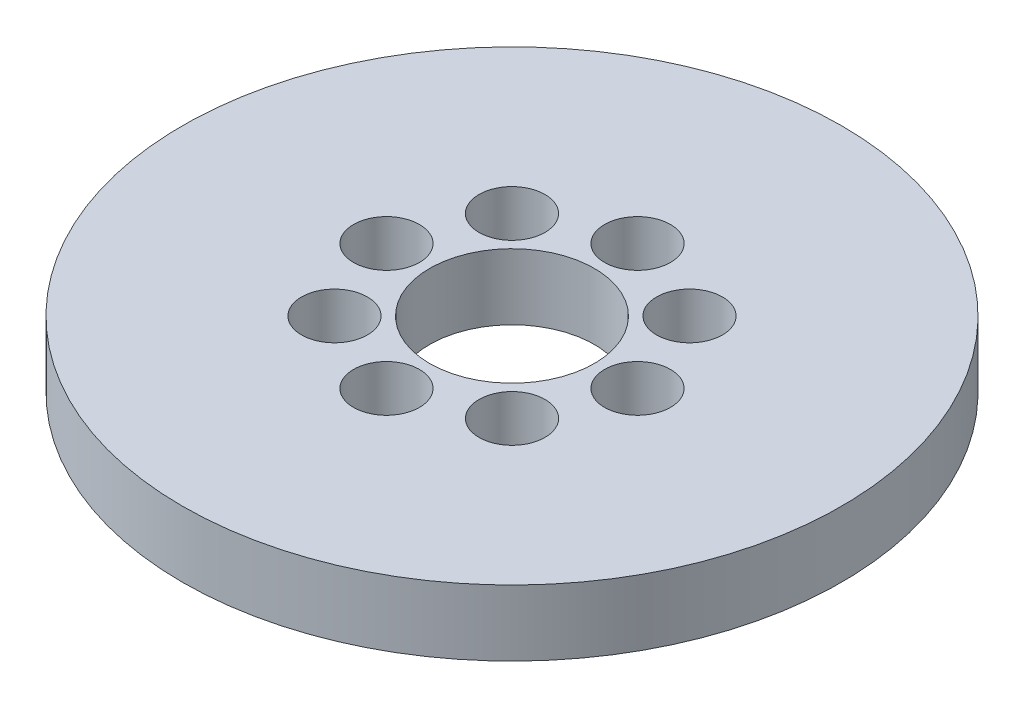
ISO-10303-21;
HEADER;
FILE_DESCRIPTION(('STEP AP214'),'2;1');
FILE_NAME('part.step','',(''),(''),'','','');
FILE_SCHEMA(('AUTOMOTIVE_DESIGN { 1 0 10303 214 1 1 1 1 }'));
ENDSEC;
DATA;
#1=APPLICATION_CONTEXT('core data for automotive mechanical design processes');
#2=APPLICATION_PROTOCOL_DEFINITION('international standard','automotive_design',2000,#1);
#3=PRODUCT_CONTEXT('',#1,'mechanical');
#4=PRODUCT('Part','Part','',(#3));
#5=PRODUCT_RELATED_PRODUCT_CATEGORY('part','',(#4));
#6=PRODUCT_DEFINITION_FORMATION('','',#4);
#7=PRODUCT_DEFINITION_CONTEXT('part definition',#1,'design');
#8=PRODUCT_DEFINITION('design','',#6,#7);
#9=PRODUCT_DEFINITION_SHAPE('','',#8);
#10=(LENGTH_UNIT() NAMED_UNIT(*) SI_UNIT(.MILLI.,.METRE.));
#11=(NAMED_UNIT(*) PLANE_ANGLE_UNIT() SI_UNIT($,.RADIAN.));
#12=(NAMED_UNIT(*) SI_UNIT($,.STERADIAN.) SOLID_ANGLE_UNIT());
#13=UNCERTAINTY_MEASURE_WITH_UNIT(LENGTH_MEASURE(1.E-05),#10,'distance_accuracy_value','');
#14=(GEOMETRIC_REPRESENTATION_CONTEXT(3) GLOBAL_UNCERTAINTY_ASSIGNED_CONTEXT((#13)) GLOBAL_UNIT_ASSIGNED_CONTEXT((#10,
#11,#12)) REPRESENTATION_CONTEXT('',''));
#15=CARTESIAN_POINT('',(0.,0.,0.));
#16=DIRECTION('',(0.,0.,1.));
#17=DIRECTION('',(1.,0.,0.));
#18=AXIS2_PLACEMENT_3D('',#15,#16,#17);
#19=CARTESIAN_POINT('',(0.,20.,0.));
#20=DIRECTION('',(0.,-1.,0.));
#21=DIRECTION('',(0.,0.,-1.));
#22=AXIS2_PLACEMENT_3D('',#19,#20,#21);
#23=CYLINDRICAL_SURFACE('',#22,100.);
#24=CARTESIAN_POINT('',(0.,20.,0.));
#25=DIRECTION('',(0.,1.,0.));
#26=DIRECTION('',(0.,0.,1.));
#27=AXIS2_PLACEMENT_3D('',#24,#25,#26);
#28=CIRCLE('',#27,100.);
#29=CARTESIAN_POINT('',(0.,20.,100.));
#30=VERTEX_POINT('',#29);
#31=EDGE_CURVE('E10',#30,#30,#28,.T.);
#32=ORIENTED_EDGE('',*,*,#31,.F.);
#33=EDGE_LOOP('',(#32));
#34=FACE_BOUND('',#33,.T.);
#35=CARTESIAN_POINT('',(0.,0.,0.));
#36=DIRECTION('',(0.,1.,0.));
#37=DIRECTION('',(0.,0.,1.));
#38=AXIS2_PLACEMENT_3D('',#35,#36,#37);
#39=CIRCLE('',#38,100.);
#40=CARTESIAN_POINT('',(0.,0.,100.));
#41=VERTEX_POINT('',#40);
#42=EDGE_CURVE('E37',#41,#41,#39,.T.);
#43=ORIENTED_EDGE('',*,*,#42,.T.);
#44=EDGE_LOOP('',(#43));
#45=FACE_BOUND('',#44,.T.);
#46=ADVANCED_FACE('F40',(#34,#45),#23,.T.);
#47=CARTESIAN_POINT('',(0.,20.,0.));
#48=DIRECTION('',(0.,1.,0.));
#49=DIRECTION('',(0.,0.,1.));
#50=AXIS2_PLACEMENT_3D('',#47,#48,#49);
#51=PLANE('',#50);
#52=CARTESIAN_POINT('',(1.32987160556969E-13,20.,38.0890366153391));
#53=DIRECTION('',(0.,1.,0.));
#54=DIRECTION('',(1.,0.,0.));
#55=AXIS2_PLACEMENT_3D('',#52,#53,#54);
#56=CIRCLE('',#55,10.);
#57=CARTESIAN_POINT('',(10.0000000000001,20.,38.089036615339));
#58=VERTEX_POINT('',#57);
#59=EDGE_CURVE('E88',#58,#58,#56,.T.);
#60=ORIENTED_EDGE('',*,*,#59,.F.);
#61=EDGE_LOOP('',(#60));
#62=FACE_BOUND('',#61,.T.);
#63=CARTESIAN_POINT('',(26.9330160795691,20.,26.9330160795688));
#64=DIRECTION('',(0.,1.,0.));
#65=DIRECTION('',(0.707106781186544,0.,-0.707106781186551));
#66=AXIS2_PLACEMENT_3D('',#63,#64,#65);
#67=CIRCLE('',#66,10.);
#68=CARTESIAN_POINT('',(34.0040838914345,20.,19.8619482677033));
#69=VERTEX_POINT('',#68);
#70=EDGE_CURVE('E79',#69,#69,#67,.T.);
#71=ORIENTED_EDGE('',*,*,#70,.F.);
#72=EDGE_LOOP('',(#71));
#73=FACE_BOUND('',#72,.T.);
#74=CARTESIAN_POINT('',(38.0890366153391,20.,0.));
#75=DIRECTION('',(0.,1.,0.));
#76=DIRECTION('',(0.,0.,-1.));
#77=AXIS2_PLACEMENT_3D('',#74,#75,#76);
#78=CIRCLE('',#77,10.);
#79=CARTESIAN_POINT('',(38.0890366153391,20.,-10.));
#80=VERTEX_POINT('',#79);
#81=EDGE_CURVE('E74',#80,#80,#78,.T.);
#82=ORIENTED_EDGE('',*,*,#81,.F.);
#83=EDGE_LOOP('',(#82));
#84=FACE_BOUND('',#83,.T.);
#85=CARTESIAN_POINT('',(26.9330160795687,20.,-26.9330160795692));
#86=DIRECTION('',(0.,1.,0.));
#87=DIRECTION('',(-0.707106781186554,0.,-0.707106781186541));
#88=AXIS2_PLACEMENT_3D('',#85,#86,#87);
#89=CIRCLE('',#88,10.);
#90=CARTESIAN_POINT('',(19.8619482677032,20.,-34.0040838914346));
#91=VERTEX_POINT('',#90);
#92=EDGE_CURVE('E70',#91,#91,#89,.T.);
#93=ORIENTED_EDGE('',*,*,#92,.F.);
#94=EDGE_LOOP('',(#93));
#95=FACE_BOUND('',#94,.T.);
#96=CARTESIAN_POINT('',(-3.98961481670907E-13,20.,-38.0890366153391));
#97=DIRECTION('',(0.,1.,0.));
#98=DIRECTION('',(-1.,0.,0.));
#99=AXIS2_PLACEMENT_3D('',#96,#97,#98);
#100=CIRCLE('',#99,10.);
#101=CARTESIAN_POINT('',(-10.0000000000004,20.,-38.089036615339));
#102=VERTEX_POINT('',#101);
#103=EDGE_CURVE('E100',#102,#102,#100,.T.);
#104=ORIENTED_EDGE('',*,*,#103,.F.);
#105=EDGE_LOOP('',(#104));
#106=FACE_BOUND('',#105,.T.);
#107=CARTESIAN_POINT('',(-26.9330160795693,20.,-26.9330160795686));
#108=DIRECTION('',(0.,1.,0.));
#109=DIRECTION('',(-0.707106781186539,0.,0.707106781186556));
#110=AXIS2_PLACEMENT_3D('',#107,#108,#109);
#111=CIRCLE('',#110,10.);
#112=CARTESIAN_POINT('',(-34.0040838914347,20.,-19.8619482677031));
#113=VERTEX_POINT('',#112);
#114=EDGE_CURVE('E93',#113,#113,#111,.T.);
#115=ORIENTED_EDGE('',*,*,#114,.F.);
#116=EDGE_LOOP('',(#115));
#117=FACE_BOUND('',#116,.T.);
#118=CARTESIAN_POINT('',(-26.9330160795689,20.,26.933016079569));
#119=DIRECTION('',(0.,1.,0.));
#120=DIRECTION('',(0.707106781186549,0.,0.707106781186546));
#121=AXIS2_PLACEMENT_3D('',#118,#119,#120);
#122=CIRCLE('',#121,10.);
#123=CARTESIAN_POINT('',(-19.8619482677034,20.,34.0040838914345));
#124=VERTEX_POINT('',#123);
#125=EDGE_CURVE('E61',#124,#124,#122,.T.);
#126=ORIENTED_EDGE('',*,*,#125,.F.);
#127=EDGE_LOOP('',(#126));
#128=FACE_BOUND('',#127,.T.);
#129=CARTESIAN_POINT('',(-38.0890366153391,20.,0.));
#130=DIRECTION('',(0.,1.,0.));
#131=DIRECTION('',(0.,0.,1.));
#132=AXIS2_PLACEMENT_3D('',#129,#130,#131);
#133=CIRCLE('',#132,10.);
#134=CARTESIAN_POINT('',(-38.0890366153391,20.,10.));
#135=VERTEX_POINT('',#134);
#136=EDGE_CURVE('E54',#135,#135,#133,.T.);
#137=ORIENTED_EDGE('',*,*,#136,.F.);
#138=EDGE_LOOP('',(#137));
#139=FACE_BOUND('',#138,.T.);
#140=CARTESIAN_POINT('',(0.,20.,0.));
#141=DIRECTION('',(0.,1.,0.));
#142=DIRECTION('',(0.,0.,1.));
#143=AXIS2_PLACEMENT_3D('',#140,#141,#142);
#144=CIRCLE('',#143,25.);
#145=CARTESIAN_POINT('',(0.,20.,25.));
#146=VERTEX_POINT('',#145);
#147=EDGE_CURVE('E50',#146,#146,#144,.T.);
#148=ORIENTED_EDGE('',*,*,#147,.F.);
#149=EDGE_LOOP('',(#148));
#150=FACE_BOUND('',#149,.T.);
#151=ORIENTED_EDGE('',*,*,#31,.T.);
#152=EDGE_LOOP('',(#151));
#153=FACE_BOUND('',#152,.T.);
#154=ADVANCED_FACE('F115',(#62,#73,#84,#95,#106,#117,#128,#139,#150,#153),#51,.T.);
#155=CARTESIAN_POINT('',(0.,0.,0.));
#156=DIRECTION('',(0.,1.,0.));
#157=DIRECTION('',(0.,0.,1.));
#158=AXIS2_PLACEMENT_3D('',#155,#156,#157);
#159=PLANE('',#158);
#160=CARTESIAN_POINT('',(0.,0.,0.));
#161=DIRECTION('',(0.,1.,0.));
#162=DIRECTION('',(0.,0.,1.));
#163=AXIS2_PLACEMENT_3D('',#160,#161,#162);
#164=CIRCLE('',#163,25.);
#165=CARTESIAN_POINT('',(0.,0.,25.));
#166=VERTEX_POINT('',#165);
#167=EDGE_CURVE('E47',#166,#166,#164,.T.);
#168=ORIENTED_EDGE('',*,*,#167,.T.);
#169=EDGE_LOOP('',(#168));
#170=FACE_BOUND('',#169,.T.);
#171=ORIENTED_EDGE('',*,*,#42,.F.);
#172=EDGE_LOOP('',(#171));
#173=FACE_BOUND('',#172,.T.);
#174=ADVANCED_FACE('F113',(#170,#173),#159,.F.);
#175=CARTESIAN_POINT('',(0.,20.,0.));
#176=DIRECTION('',(0.,-1.,0.));
#177=DIRECTION('',(0.,0.,-1.));
#178=AXIS2_PLACEMENT_3D('',#175,#176,#177);
#179=CYLINDRICAL_SURFACE('',#178,25.);
#180=ORIENTED_EDGE('',*,*,#147,.T.);
#181=EDGE_LOOP('',(#180));
#182=FACE_BOUND('',#181,.T.);
#183=ORIENTED_EDGE('',*,*,#167,.F.);
#184=EDGE_LOOP('',(#183));
#185=FACE_BOUND('',#184,.T.);
#186=ADVANCED_FACE('F127',(#182,#185),#179,.F.);
#187=CARTESIAN_POINT('',(-38.0890366153391,2.16117875302483,0.));
#188=DIRECTION('',(0.,1.,0.));
#189=DIRECTION('',(0.,0.,1.));
#190=AXIS2_PLACEMENT_3D('',#187,#188,#189);
#191=CYLINDRICAL_SURFACE('',#190,10.);
#192=CARTESIAN_POINT('',(-38.0890366153391,2.16117875302483,0.));
#193=DIRECTION('',(0.,1.,0.));
#194=DIRECTION('',(0.,0.,1.));
#195=AXIS2_PLACEMENT_3D('',#192,#193,#194);
#196=CIRCLE('',#195,10.);
#197=CARTESIAN_POINT('',(-38.0890366153391,2.16117875302483,10.));
#198=VERTEX_POINT('',#197);
#199=EDGE_CURVE('E55',#198,#198,#196,.T.);
#200=ORIENTED_EDGE('',*,*,#199,.F.);
#201=EDGE_LOOP('',(#200));
#202=FACE_BOUND('',#201,.T.);
#203=ORIENTED_EDGE('',*,*,#136,.T.);
#204=EDGE_LOOP('',(#203));
#205=FACE_BOUND('',#204,.T.);
#206=ADVANCED_FACE('F129',(#202,#205),#191,.F.);
#207=CARTESIAN_POINT('',(-38.0890366153391,2.16117875302483,0.));
#208=DIRECTION('',(0.,1.,0.));
#209=DIRECTION('',(0.,0.,1.));
#210=AXIS2_PLACEMENT_3D('',#207,#208,#209);
#211=PLANE('',#210);
#212=ORIENTED_EDGE('',*,*,#199,.T.);
#213=EDGE_LOOP('',(#212));
#214=FACE_BOUND('',#213,.T.);
#215=ADVANCED_FACE('F157',(#214),#211,.T.);
#216=CARTESIAN_POINT('',(-26.9330160795689,2.16117875302483,26.933016079569));
#217=DIRECTION('',(0.,1.,0.));
#218=DIRECTION('',(0.,0.,1.));
#219=AXIS2_PLACEMENT_3D('',#216,#217,#218);
#220=CYLINDRICAL_SURFACE('',#219,10.);
#221=CARTESIAN_POINT('',(-26.9330160795689,2.16117875302483,26.933016079569));
#222=DIRECTION('',(0.,1.,0.));
#223=DIRECTION('',(0.707106781186549,0.,0.707106781186546));
#224=AXIS2_PLACEMENT_3D('',#221,#222,#223);
#225=CIRCLE('',#224,10.);
#226=CARTESIAN_POINT('',(-19.8619482677034,2.16117875302483,34.0040838914345));
#227=VERTEX_POINT('',#226);
#228=EDGE_CURVE('E59',#227,#227,#225,.T.);
#229=ORIENTED_EDGE('',*,*,#228,.F.);
#230=EDGE_LOOP('',(#229));
#231=FACE_BOUND('',#230,.T.);
#232=ORIENTED_EDGE('',*,*,#125,.T.);
#233=EDGE_LOOP('',(#232));
#234=FACE_BOUND('',#233,.T.);
#235=ADVANCED_FACE('F170',(#231,#234),#220,.F.);
#236=CARTESIAN_POINT('',(-26.9330160795689,2.16117875302483,26.933016079569));
#237=DIRECTION('',(0.,1.,0.));
#238=DIRECTION('',(0.707106781186549,0.,0.707106781186546));
#239=AXIS2_PLACEMENT_3D('',#236,#237,#238);
#240=PLANE('',#239);
#241=ORIENTED_EDGE('',*,*,#228,.T.);
#242=EDGE_LOOP('',(#241));
#243=FACE_BOUND('',#242,.T.);
#244=ADVANCED_FACE('F182',(#243),#240,.T.);
#245=CARTESIAN_POINT('',(-26.9330160795693,2.16117875302483,-26.9330160795686));
#246=DIRECTION('',(0.,1.,0.));
#247=DIRECTION('',(0.,0.,1.));
#248=AXIS2_PLACEMENT_3D('',#245,#246,#247);
#249=CYLINDRICAL_SURFACE('',#248,10.);
#250=CARTESIAN_POINT('',(-26.9330160795693,2.16117875302483,-26.9330160795686));
#251=DIRECTION('',(0.,1.,0.));
#252=DIRECTION('',(-0.707106781186539,0.,0.707106781186556));
#253=AXIS2_PLACEMENT_3D('',#250,#251,#252);
#254=CIRCLE('',#253,10.);
#255=CARTESIAN_POINT('',(-34.0040838914347,2.16117875302483,-19.8619482677031));
#256=VERTEX_POINT('',#255);
#257=EDGE_CURVE('E94',#256,#256,#254,.T.);
#258=ORIENTED_EDGE('',*,*,#257,.F.);
#259=EDGE_LOOP('',(#258));
#260=FACE_BOUND('',#259,.T.);
#261=ORIENTED_EDGE('',*,*,#114,.T.);
#262=EDGE_LOOP('',(#261));
#263=FACE_BOUND('',#262,.T.);
#264=ADVANCED_FACE('F189',(#260,#263),#249,.F.);
#265=CARTESIAN_POINT('',(-26.9330160795693,2.16117875302483,-26.9330160795686));
#266=DIRECTION('',(0.,1.,0.));
#267=DIRECTION('',(-0.707106781186539,0.,0.707106781186556));
#268=AXIS2_PLACEMENT_3D('',#265,#266,#267);
#269=PLANE('',#268);
#270=ORIENTED_EDGE('',*,*,#257,.T.);
#271=EDGE_LOOP('',(#270));
#272=FACE_BOUND('',#271,.T.);
#273=ADVANCED_FACE('F107',(#272),#269,.T.);
#274=CARTESIAN_POINT('',(-3.98961481670907E-13,2.16117875302483,-38.0890366153391));
#275=DIRECTION('',(0.,1.,0.));
#276=DIRECTION('',(0.,0.,1.));
#277=AXIS2_PLACEMENT_3D('',#274,#275,#276);
#278=CYLINDRICAL_SURFACE('',#277,10.);
#279=CARTESIAN_POINT('',(-3.98961481670907E-13,2.16117875302483,-38.0890366153391));
#280=DIRECTION('',(0.,1.,0.));
#281=DIRECTION('',(-1.,0.,0.));
#282=AXIS2_PLACEMENT_3D('',#279,#280,#281);
#283=CIRCLE('',#282,10.);
#284=CARTESIAN_POINT('',(-10.0000000000004,2.16117875302483,-38.089036615339));
#285=VERTEX_POINT('',#284);
#286=EDGE_CURVE('E72',#285,#285,#283,.T.);
#287=ORIENTED_EDGE('',*,*,#286,.F.);
#288=EDGE_LOOP('',(#287));
#289=FACE_BOUND('',#288,.T.);
#290=ORIENTED_EDGE('',*,*,#103,.T.);
#291=EDGE_LOOP('',(#290));
#292=FACE_BOUND('',#291,.T.);
#293=ADVANCED_FACE('F104',(#289,#292),#278,.F.);
#294=CARTESIAN_POINT('',(-3.98961481670907E-13,2.16117875302483,-38.0890366153391));
#295=DIRECTION('',(0.,1.,0.));
#296=DIRECTION('',(-1.,0.,0.));
#297=AXIS2_PLACEMENT_3D('',#294,#295,#296);
#298=PLANE('',#297);
#299=ORIENTED_EDGE('',*,*,#286,.T.);
#300=EDGE_LOOP('',(#299));
#301=FACE_BOUND('',#300,.T.);
#302=ADVANCED_FACE('F103',(#301),#298,.T.);
#303=CARTESIAN_POINT('',(26.9330160795687,2.16117875302483,-26.9330160795692));
#304=DIRECTION('',(0.,1.,0.));
#305=DIRECTION('',(0.,0.,1.));
#306=AXIS2_PLACEMENT_3D('',#303,#304,#305);
#307=CYLINDRICAL_SURFACE('',#306,10.);
#308=CARTESIAN_POINT('',(26.9330160795687,2.16117875302483,-26.9330160795692));
#309=DIRECTION('',(0.,1.,0.));
#310=DIRECTION('',(-0.707106781186554,0.,-0.707106781186541));
#311=AXIS2_PLACEMENT_3D('',#308,#309,#310);
#312=CIRCLE('',#311,10.);
#313=CARTESIAN_POINT('',(19.8619482677032,2.16117875302483,-34.0040838914346));
#314=VERTEX_POINT('',#313);
#315=EDGE_CURVE('E69',#314,#314,#312,.T.);
#316=ORIENTED_EDGE('',*,*,#315,.F.);
#317=EDGE_LOOP('',(#316));
#318=FACE_BOUND('',#317,.T.);
#319=ORIENTED_EDGE('',*,*,#92,.T.);
#320=EDGE_LOOP('',(#319));
#321=FACE_BOUND('',#320,.T.);
#322=ADVANCED_FACE('F219',(#318,#321),#307,.F.);
#323=CARTESIAN_POINT('',(26.9330160795687,2.16117875302483,-26.9330160795692));
#324=DIRECTION('',(0.,1.,0.));
#325=DIRECTION('',(-0.707106781186554,0.,-0.707106781186541));
#326=AXIS2_PLACEMENT_3D('',#323,#324,#325);
#327=PLANE('',#326);
#328=ORIENTED_EDGE('',*,*,#315,.T.);
#329=EDGE_LOOP('',(#328));
#330=FACE_BOUND('',#329,.T.);
#331=ADVANCED_FACE('F227',(#330),#327,.T.);
#332=CARTESIAN_POINT('',(38.0890366153391,2.16117875302483,0.));
#333=DIRECTION('',(0.,1.,0.));
#334=DIRECTION('',(0.,0.,1.));
#335=AXIS2_PLACEMENT_3D('',#332,#333,#334);
#336=CYLINDRICAL_SURFACE('',#335,10.);
#337=CARTESIAN_POINT('',(38.0890366153391,2.16117875302483,0.));
#338=DIRECTION('',(0.,1.,0.));
#339=DIRECTION('',(0.,0.,-1.));
#340=AXIS2_PLACEMENT_3D('',#337,#338,#339);
#341=CIRCLE('',#340,10.);
#342=CARTESIAN_POINT('',(38.0890366153391,2.16117875302483,-10.));
#343=VERTEX_POINT('',#342);
#344=EDGE_CURVE('E80',#343,#343,#341,.T.);
#345=ORIENTED_EDGE('',*,*,#344,.F.);
#346=EDGE_LOOP('',(#345));
#347=FACE_BOUND('',#346,.T.);
#348=ORIENTED_EDGE('',*,*,#81,.T.);
#349=EDGE_LOOP('',(#348));
#350=FACE_BOUND('',#349,.T.);
#351=ADVANCED_FACE('F240',(#347,#350),#336,.F.);
#352=CARTESIAN_POINT('',(38.0890366153391,2.16117875302483,0.));
#353=DIRECTION('',(0.,1.,0.));
#354=DIRECTION('',(0.,0.,-1.));
#355=AXIS2_PLACEMENT_3D('',#352,#353,#354);
#356=PLANE('',#355);
#357=ORIENTED_EDGE('',*,*,#344,.T.);
#358=EDGE_LOOP('',(#357));
#359=FACE_BOUND('',#358,.T.);
#360=ADVANCED_FACE('F246',(#359),#356,.T.);
#361=CARTESIAN_POINT('',(26.9330160795691,2.16117875302483,26.9330160795688));
#362=DIRECTION('',(0.,1.,0.));
#363=DIRECTION('',(0.,0.,1.));
#364=AXIS2_PLACEMENT_3D('',#361,#362,#363);
#365=CYLINDRICAL_SURFACE('',#364,10.);
#366=CARTESIAN_POINT('',(26.9330160795691,2.16117875302483,26.9330160795688));
#367=DIRECTION('',(0.,1.,0.));
#368=DIRECTION('',(0.707106781186544,0.,-0.707106781186551));
#369=AXIS2_PLACEMENT_3D('',#366,#367,#368);
#370=CIRCLE('',#369,10.);
#371=CARTESIAN_POINT('',(34.0040838914345,2.16117875302483,19.8619482677033));
#372=VERTEX_POINT('',#371);
#373=EDGE_CURVE('E82',#372,#372,#370,.T.);
#374=ORIENTED_EDGE('',*,*,#373,.F.);
#375=EDGE_LOOP('',(#374));
#376=FACE_BOUND('',#375,.T.);
#377=ORIENTED_EDGE('',*,*,#70,.T.);
#378=EDGE_LOOP('',(#377));
#379=FACE_BOUND('',#378,.T.);
#380=ADVANCED_FACE('F254',(#376,#379),#365,.F.);
#381=CARTESIAN_POINT('',(26.9330160795691,2.16117875302483,26.9330160795688));
#382=DIRECTION('',(0.,1.,0.));
#383=DIRECTION('',(0.707106781186544,0.,-0.707106781186551));
#384=AXIS2_PLACEMENT_3D('',#381,#382,#383);
#385=PLANE('',#384);
#386=ORIENTED_EDGE('',*,*,#373,.T.);
#387=EDGE_LOOP('',(#386));
#388=FACE_BOUND('',#387,.T.);
#389=ADVANCED_FACE('F262',(#388),#385,.T.);
#390=CARTESIAN_POINT('',(1.32987160556969E-13,2.16117875302483,38.0890366153391));
#391=DIRECTION('',(0.,1.,0.));
#392=DIRECTION('',(0.,0.,1.));
#393=AXIS2_PLACEMENT_3D('',#390,#391,#392);
#394=CYLINDRICAL_SURFACE('',#393,10.);
#395=CARTESIAN_POINT('',(1.32987160556969E-13,2.16117875302483,38.0890366153391));
#396=DIRECTION('',(0.,1.,0.));
#397=DIRECTION('',(1.,0.,0.));
#398=AXIS2_PLACEMENT_3D('',#395,#396,#397);
#399=CIRCLE('',#398,10.);
#400=CARTESIAN_POINT('',(10.0000000000001,2.16117875302483,38.089036615339));
#401=VERTEX_POINT('',#400);
#402=EDGE_CURVE('E63',#401,#401,#399,.T.);
#403=ORIENTED_EDGE('',*,*,#402,.F.);
#404=EDGE_LOOP('',(#403));
#405=FACE_BOUND('',#404,.T.);
#406=ORIENTED_EDGE('',*,*,#59,.T.);
#407=EDGE_LOOP('',(#406));
#408=FACE_BOUND('',#407,.T.);
#409=ADVANCED_FACE('F272',(#405,#408),#394,.F.);
#410=CARTESIAN_POINT('',(1.32987160556969E-13,2.16117875302483,38.0890366153391));
#411=DIRECTION('',(0.,1.,0.));
#412=DIRECTION('',(1.,0.,0.));
#413=AXIS2_PLACEMENT_3D('',#410,#411,#412);
#414=PLANE('',#413);
#415=ORIENTED_EDGE('',*,*,#402,.T.);
#416=EDGE_LOOP('',(#415));
#417=FACE_BOUND('',#416,.T.);
#418=ADVANCED_FACE('F285',(#417),#414,.T.);
#419=CLOSED_SHELL('',(#46,#154,#174,#186,#206,#215,#235,#244,#264,#273,#293,#302,#322,#331,#351,
#360,#380,#389,#409,#418));
#420=MANIFOLD_SOLID_BREP('B2',#419);
#421=ADVANCED_BREP_SHAPE_REPRESENTATION('',(#18,#420),#14);
#422=SHAPE_DEFINITION_REPRESENTATION(#9,#421);
ENDSEC;
END-ISO-10303-21;
